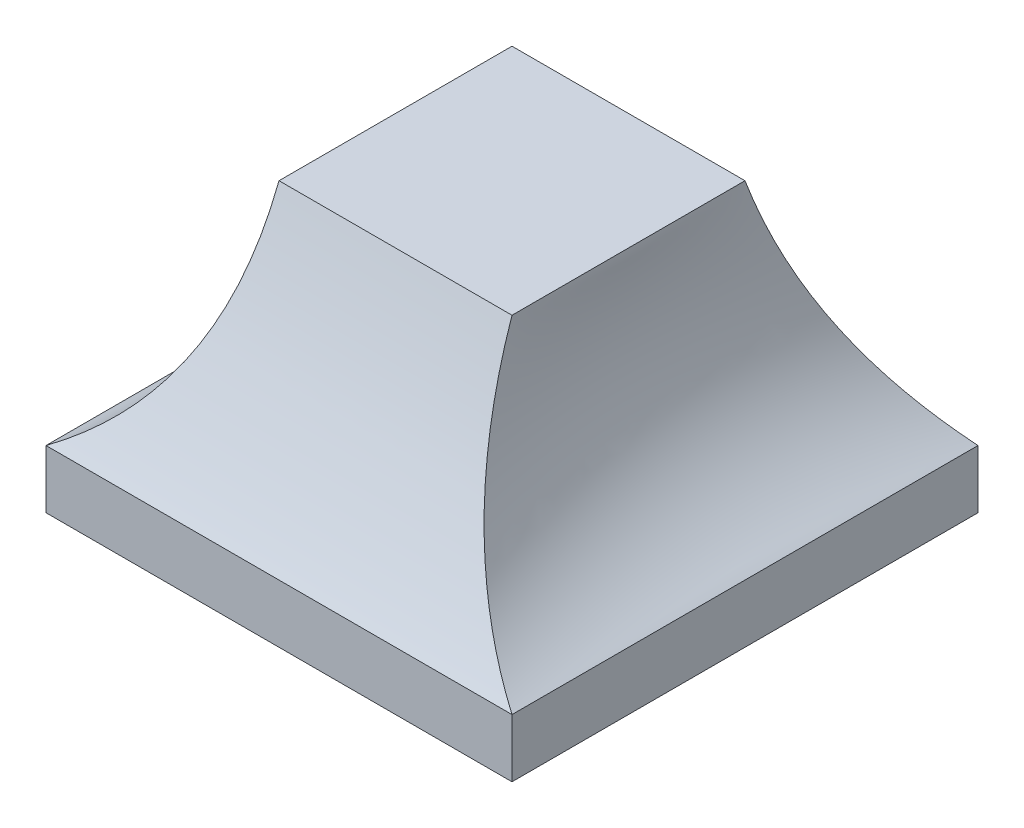
ISO-10303-21;
HEADER;
FILE_DESCRIPTION(('STEP AP214'),'2;1');
FILE_NAME('part.step','',(''),(''),'','','');
FILE_SCHEMA(('AUTOMOTIVE_DESIGN { 1 0 10303 214 1 1 1 1 }'));
ENDSEC;
DATA;
#1=APPLICATION_CONTEXT('core data for automotive mechanical design processes');
#2=APPLICATION_PROTOCOL_DEFINITION('international standard','automotive_design',2000,#1);
#3=PRODUCT_CONTEXT('',#1,'mechanical');
#4=PRODUCT('Part','Part','',(#3));
#5=PRODUCT_RELATED_PRODUCT_CATEGORY('part','',(#4));
#6=PRODUCT_DEFINITION_FORMATION('','',#4);
#7=PRODUCT_DEFINITION_CONTEXT('part definition',#1,'design');
#8=PRODUCT_DEFINITION('design','',#6,#7);
#9=PRODUCT_DEFINITION_SHAPE('','',#8);
#10=(LENGTH_UNIT() NAMED_UNIT(*) SI_UNIT(.MILLI.,.METRE.));
#11=(NAMED_UNIT(*) PLANE_ANGLE_UNIT() SI_UNIT($,.RADIAN.));
#12=(NAMED_UNIT(*) SI_UNIT($,.STERADIAN.) SOLID_ANGLE_UNIT());
#13=UNCERTAINTY_MEASURE_WITH_UNIT(LENGTH_MEASURE(1.E-05),#10,'distance_accuracy_value','');
#14=(GEOMETRIC_REPRESENTATION_CONTEXT(3) GLOBAL_UNCERTAINTY_ASSIGNED_CONTEXT((#13)) GLOBAL_UNIT_ASSIGNED_CONTEXT((#10,
#11,#12)) REPRESENTATION_CONTEXT('',''));
#15=CARTESIAN_POINT('',(0.,0.,0.));
#16=DIRECTION('',(0.,0.,1.));
#17=DIRECTION('',(1.,0.,0.));
#18=AXIS2_PLACEMENT_3D('',#15,#16,#17);
#19=CARTESIAN_POINT('',(0.,0.,0.));
#20=DIRECTION('',(0.,1.,0.));
#21=DIRECTION('',(0.,0.,1.));
#22=AXIS2_PLACEMENT_3D('',#19,#20,#21);
#23=PLANE('',#22);
#24=DIRECTION('',(0.,0.,-1.));
#25=VECTOR('',#24,1.);
#26=CARTESIAN_POINT('',(25.4,0.,-25.4));
#27=LINE('',#26,#25);
#28=CARTESIAN_POINT('',(25.4,0.,25.4));
#29=VERTEX_POINT('',#28);
#30=CARTESIAN_POINT('',(25.4,0.,-25.4));
#31=VERTEX_POINT('',#30);
#32=EDGE_CURVE('E416',#29,#31,#27,.T.);
#33=ORIENTED_EDGE('',*,*,#32,.F.);
#34=DIRECTION('',(1.,0.,0.));
#35=VECTOR('',#34,1.);
#36=CARTESIAN_POINT('',(-25.4,0.,25.4));
#37=LINE('',#36,#35);
#38=CARTESIAN_POINT('',(-25.4,0.,25.4));
#39=VERTEX_POINT('',#38);
#40=EDGE_CURVE('E175',#39,#29,#37,.T.);
#41=ORIENTED_EDGE('',*,*,#40,.F.);
#42=DIRECTION('',(0.,0.,1.));
#43=VECTOR('',#42,1.);
#44=CARTESIAN_POINT('',(-25.4,0.,-25.4));
#45=LINE('',#44,#43);
#46=CARTESIAN_POINT('',(-25.4,0.,-25.4));
#47=VERTEX_POINT('',#46);
#48=EDGE_CURVE('E423',#47,#39,#45,.T.);
#49=ORIENTED_EDGE('',*,*,#48,.F.);
#50=DIRECTION('',(-1.,0.,0.));
#51=VECTOR('',#50,1.);
#52=CARTESIAN_POINT('',(-25.4,0.,-25.4));
#53=LINE('',#52,#51);
#54=EDGE_CURVE('E420',#31,#47,#53,.T.);
#55=ORIENTED_EDGE('',*,*,#54,.F.);
#56=EDGE_LOOP('',(#33,#41,#49,#55));
#57=FACE_BOUND('',#56,.T.);
#58=CARTESIAN_POINT('',(-12.7,0.,-12.7));
#59=DIRECTION('',(0.,1.,0.));
#60=DIRECTION('',(0.,0.,1.));
#61=AXIS2_PLACEMENT_3D('',#58,#59,#60);
#62=CIRCLE('',#61,3.175);
#63=CARTESIAN_POINT('',(-12.7,0.,-9.525));
#64=VERTEX_POINT('',#63);
#65=EDGE_CURVE('E412',#64,#64,#62,.T.);
#66=ORIENTED_EDGE('',*,*,#65,.T.);
#67=EDGE_LOOP('',(#66));
#68=FACE_BOUND('',#67,.T.);
#69=CARTESIAN_POINT('',(12.7,0.,-12.7));
#70=DIRECTION('',(0.,1.,0.));
#71=DIRECTION('',(0.,0.,1.));
#72=AXIS2_PLACEMENT_3D('',#69,#70,#71);
#73=CIRCLE('',#72,3.40946307943457);
#74=CARTESIAN_POINT('',(12.7,0.,-9.29053692056542));
#75=VERTEX_POINT('',#74);
#76=EDGE_CURVE('E408',#75,#75,#73,.T.);
#77=ORIENTED_EDGE('',*,*,#76,.T.);
#78=EDGE_LOOP('',(#77));
#79=FACE_BOUND('',#78,.T.);
#80=CARTESIAN_POINT('',(12.7,0.,12.7));
#81=DIRECTION('',(0.,1.,0.));
#82=DIRECTION('',(0.,0.,-1.));
#83=AXIS2_PLACEMENT_3D('',#80,#81,#82);
#84=CIRCLE('',#83,3.40946307943457);
#85=CARTESIAN_POINT('',(12.7,0.,9.29053692056542));
#86=VERTEX_POINT('',#85);
#87=EDGE_CURVE('E405',#86,#86,#84,.T.);
#88=ORIENTED_EDGE('',*,*,#87,.T.);
#89=EDGE_LOOP('',(#88));
#90=FACE_BOUND('',#89,.T.);
#91=CARTESIAN_POINT('',(-12.7,0.,12.7));
#92=DIRECTION('',(0.,1.,0.));
#93=DIRECTION('',(0.,0.,-1.));
#94=AXIS2_PLACEMENT_3D('',#91,#92,#93);
#95=CIRCLE('',#94,3.175);
#96=CARTESIAN_POINT('',(-12.7,0.,9.525));
#97=VERTEX_POINT('',#96);
#98=EDGE_CURVE('E401',#97,#97,#95,.T.);
#99=ORIENTED_EDGE('',*,*,#98,.T.);
#100=EDGE_LOOP('',(#99));
#101=FACE_BOUND('',#100,.T.);
#102=ADVANCED_FACE('F139',(#57,#68,#79,#90,#101),#23,.F.);
#103=CARTESIAN_POINT('',(25.4,6.35,-25.4));
#104=DIRECTION('',(-1.,0.,0.));
#105=DIRECTION('',(0.,0.,1.));
#106=AXIS2_PLACEMENT_3D('',#103,#104,#105);
#107=PLANE('',#106);
#108=ORIENTED_EDGE('',*,*,#32,.T.);
#109=DIRECTION('',(0.,-1.,0.));
#110=VECTOR('',#109,1.);
#111=CARTESIAN_POINT('',(25.4,6.35,-25.4));
#112=LINE('',#111,#110);
#113=CARTESIAN_POINT('',(25.4,6.34999999999999,-25.4));
#114=VERTEX_POINT('',#113);
#115=EDGE_CURVE('E13',#114,#31,#112,.T.);
#116=ORIENTED_EDGE('',*,*,#115,.F.);
#117=DIRECTION('',(0.,0.,1.));
#118=VECTOR('',#117,1.);
#119=CARTESIAN_POINT('',(25.4,6.35,-25.4));
#120=LINE('',#119,#118);
#121=CARTESIAN_POINT('',(25.4,6.35,25.4));
#122=VERTEX_POINT('',#121);
#123=EDGE_CURVE('E225',#122,#114,#120,.F.);
#124=ORIENTED_EDGE('',*,*,#123,.F.);
#125=DIRECTION('',(0.,-1.,0.));
#126=VECTOR('',#125,1.);
#127=CARTESIAN_POINT('',(25.4,6.35,25.4));
#128=LINE('',#127,#126);
#129=EDGE_CURVE('E437',#122,#29,#128,.T.);
#130=ORIENTED_EDGE('',*,*,#129,.T.);
#131=EDGE_LOOP('',(#108,#116,#124,#130));
#132=FACE_BOUND('',#131,.T.);
#133=ADVANCED_FACE('F141',(#132),#107,.F.);
#134=CARTESIAN_POINT('',(-25.4,6.35,-25.4));
#135=DIRECTION('',(0.,0.,1.));
#136=DIRECTION('',(1.,0.,0.));
#137=AXIS2_PLACEMENT_3D('',#134,#135,#136);
#138=PLANE('',#137);
#139=ORIENTED_EDGE('',*,*,#54,.T.);
#140=DIRECTION('',(0.,-1.,0.));
#141=VECTOR('',#140,1.);
#142=CARTESIAN_POINT('',(-25.4,6.35,-25.4));
#143=LINE('',#142,#141);
#144=CARTESIAN_POINT('',(-25.4,6.35,-25.4));
#145=VERTEX_POINT('',#144);
#146=EDGE_CURVE('E150',#145,#47,#143,.T.);
#147=ORIENTED_EDGE('',*,*,#146,.F.);
#148=DIRECTION('',(1.,0.,0.));
#149=VECTOR('',#148,1.);
#150=CARTESIAN_POINT('',(-25.4,6.35,-25.4));
#151=LINE('',#150,#149);
#152=EDGE_CURVE('E143',#114,#145,#151,.F.);
#153=ORIENTED_EDGE('',*,*,#152,.F.);
#154=ORIENTED_EDGE('',*,*,#115,.T.);
#155=EDGE_LOOP('',(#139,#147,#153,#154));
#156=FACE_BOUND('',#155,.T.);
#157=ADVANCED_FACE('F463',(#156),#138,.F.);
#158=CARTESIAN_POINT('',(-25.4,6.35,-25.4));
#159=DIRECTION('',(1.,0.,0.));
#160=DIRECTION('',(0.,0.,-1.));
#161=AXIS2_PLACEMENT_3D('',#158,#159,#160);
#162=PLANE('',#161);
#163=ORIENTED_EDGE('',*,*,#48,.T.);
#164=DIRECTION('',(0.,-1.,0.));
#165=VECTOR('',#164,1.);
#166=CARTESIAN_POINT('',(-25.4,6.35,25.4));
#167=LINE('',#166,#165);
#168=CARTESIAN_POINT('',(-25.4,6.35,25.4));
#169=VERTEX_POINT('',#168);
#170=EDGE_CURVE('E158',#169,#39,#167,.T.);
#171=ORIENTED_EDGE('',*,*,#170,.F.);
#172=DIRECTION('',(0.,0.,-1.));
#173=VECTOR('',#172,1.);
#174=CARTESIAN_POINT('',(-25.4,6.35,-25.4));
#175=LINE('',#174,#173);
#176=EDGE_CURVE('E432',#145,#169,#175,.F.);
#177=ORIENTED_EDGE('',*,*,#176,.F.);
#178=ORIENTED_EDGE('',*,*,#146,.T.);
#179=EDGE_LOOP('',(#163,#171,#177,#178));
#180=FACE_BOUND('',#179,.T.);
#181=ADVANCED_FACE('F446',(#180),#162,.F.);
#182=CARTESIAN_POINT('',(-25.4,6.35,25.4));
#183=DIRECTION('',(0.,0.,-1.));
#184=DIRECTION('',(-1.,0.,0.));
#185=AXIS2_PLACEMENT_3D('',#182,#183,#184);
#186=PLANE('',#185);
#187=ORIENTED_EDGE('',*,*,#40,.T.);
#188=ORIENTED_EDGE('',*,*,#129,.F.);
#189=DIRECTION('',(-1.,0.,0.));
#190=VECTOR('',#189,1.);
#191=CARTESIAN_POINT('',(-25.4,6.35,25.4));
#192=LINE('',#191,#190);
#193=EDGE_CURVE('E434',#169,#122,#192,.F.);
#194=ORIENTED_EDGE('',*,*,#193,.F.);
#195=ORIENTED_EDGE('',*,*,#170,.T.);
#196=EDGE_LOOP('',(#187,#188,#194,#195));
#197=FACE_BOUND('',#196,.T.);
#198=ADVANCED_FACE('F451',(#197),#186,.F.);
#199=CARTESIAN_POINT('',(-12.7,6.35,-12.7));
#200=DIRECTION('',(0.,-1.,0.));
#201=DIRECTION('',(0.,0.,-1.));
#202=AXIS2_PLACEMENT_3D('',#199,#200,#201);
#203=CYLINDRICAL_SURFACE('',#202,3.175);
#204=CARTESIAN_POINT('',(-12.7,6.35,-12.7));
#205=DIRECTION('',(0.,1.,0.));
#206=DIRECTION('',(0.,0.,1.));
#207=AXIS2_PLACEMENT_3D('',#204,#205,#206);
#208=CIRCLE('',#207,3.175);
#209=CARTESIAN_POINT('',(-12.7,6.35,-9.525));
#210=VERTEX_POINT('',#209);
#211=EDGE_CURVE('E393',#210,#210,#208,.T.);
#212=ORIENTED_EDGE('',*,*,#211,.T.);
#213=EDGE_LOOP('',(#212));
#214=FACE_BOUND('',#213,.T.);
#215=ORIENTED_EDGE('',*,*,#65,.F.);
#216=EDGE_LOOP('',(#215));
#217=FACE_BOUND('',#216,.T.);
#218=ADVANCED_FACE('F453',(#214,#217),#203,.F.);
#219=CARTESIAN_POINT('',(12.7,6.35,-12.7));
#220=DIRECTION('',(0.,-1.,0.));
#221=DIRECTION('',(0.,0.,-1.));
#222=AXIS2_PLACEMENT_3D('',#219,#220,#221);
#223=CYLINDRICAL_SURFACE('',#222,3.40946307943457);
#224=CARTESIAN_POINT('',(12.7,6.35,-12.7));
#225=DIRECTION('',(0.,1.,0.));
#226=DIRECTION('',(0.,0.,1.));
#227=AXIS2_PLACEMENT_3D('',#224,#225,#226);
#228=CIRCLE('',#227,3.40946307943457);
#229=CARTESIAN_POINT('',(12.7,6.35,-9.29053692056542));
#230=VERTEX_POINT('',#229);
#231=EDGE_CURVE('E390',#230,#230,#228,.T.);
#232=ORIENTED_EDGE('',*,*,#231,.T.);
#233=EDGE_LOOP('',(#232));
#234=FACE_BOUND('',#233,.T.);
#235=ORIENTED_EDGE('',*,*,#76,.F.);
#236=EDGE_LOOP('',(#235));
#237=FACE_BOUND('',#236,.T.);
#238=ADVANCED_FACE('F460',(#234,#237),#223,.F.);
#239=CARTESIAN_POINT('',(12.7,6.35,12.7));
#240=DIRECTION('',(0.,-1.,0.));
#241=DIRECTION('',(0.,0.,-1.));
#242=AXIS2_PLACEMENT_3D('',#239,#240,#241);
#243=CYLINDRICAL_SURFACE('',#242,3.40946307943457);
#244=CARTESIAN_POINT('',(12.7,6.35,12.7));
#245=DIRECTION('',(0.,1.,0.));
#246=DIRECTION('',(0.,0.,-1.));
#247=AXIS2_PLACEMENT_3D('',#244,#245,#246);
#248=CIRCLE('',#247,3.40946307943457);
#249=CARTESIAN_POINT('',(12.7,6.35,9.29053692056542));
#250=VERTEX_POINT('',#249);
#251=EDGE_CURVE('E397',#250,#250,#248,.T.);
#252=ORIENTED_EDGE('',*,*,#251,.T.);
#253=EDGE_LOOP('',(#252));
#254=FACE_BOUND('',#253,.T.);
#255=ORIENTED_EDGE('',*,*,#87,.F.);
#256=EDGE_LOOP('',(#255));
#257=FACE_BOUND('',#256,.T.);
#258=ADVANCED_FACE('F472',(#254,#257),#243,.F.);
#259=CARTESIAN_POINT('',(-12.7,6.35,12.7));
#260=DIRECTION('',(0.,-1.,0.));
#261=DIRECTION('',(0.,0.,-1.));
#262=AXIS2_PLACEMENT_3D('',#259,#260,#261);
#263=CYLINDRICAL_SURFACE('',#262,3.175);
#264=CARTESIAN_POINT('',(-12.7,6.35,12.7));
#265=DIRECTION('',(0.,1.,0.));
#266=DIRECTION('',(0.,0.,-1.));
#267=AXIS2_PLACEMENT_3D('',#264,#265,#266);
#268=CIRCLE('',#267,3.175);
#269=CARTESIAN_POINT('',(-12.7,6.35,9.525));
#270=VERTEX_POINT('',#269);
#271=EDGE_CURVE('E243',#270,#270,#268,.T.);
#272=ORIENTED_EDGE('',*,*,#271,.T.);
#273=EDGE_LOOP('',(#272));
#274=FACE_BOUND('',#273,.T.);
#275=ORIENTED_EDGE('',*,*,#98,.F.);
#276=EDGE_LOOP('',(#275));
#277=FACE_BOUND('',#276,.T.);
#278=ADVANCED_FACE('F259',(#274,#277),#263,.F.);
#279=CARTESIAN_POINT('',(0.,6.35,0.));
#280=DIRECTION('',(0.,1.,0.));
#281=DIRECTION('',(0.,0.,1.));
#282=AXIS2_PLACEMENT_3D('',#279,#280,#281);
#283=PLANE('',#282);
#284=ORIENTED_EDGE('',*,*,#271,.F.);
#285=EDGE_LOOP('',(#284));
#286=FACE_BOUND('',#285,.T.);
#287=ADVANCED_FACE('F479',(#286),#283,.F.);
#288=ORIENTED_EDGE('',*,*,#231,.F.);
#289=EDGE_LOOP('',(#288));
#290=FACE_BOUND('',#289,.T.);
#291=ADVANCED_FACE('F494',(#290),#283,.F.);
#292=ORIENTED_EDGE('',*,*,#211,.F.);
#293=EDGE_LOOP('',(#292));
#294=FACE_BOUND('',#293,.T.);
#295=ADVANCED_FACE('F490',(#294),#283,.F.);
#296=ORIENTED_EDGE('',*,*,#251,.F.);
#297=EDGE_LOOP('',(#296));
#298=FACE_BOUND('',#297,.T.);
#299=ADVANCED_FACE('F254',(#298),#283,.F.);
#300=CARTESIAN_POINT('',(0.,31.35,0.));
#301=DIRECTION('',(0.,-1.,0.));
#302=DIRECTION('',(0.,0.,-1.));
#303=AXIS2_PLACEMENT_3D('',#300,#301,#302);
#304=PLANE('',#303);
#305=DIRECTION('',(0.,0.,-1.));
#306=VECTOR('',#305,1.);
#307=CARTESIAN_POINT('',(12.7,31.35,12.7));
#308=LINE('',#307,#306);
#309=CARTESIAN_POINT('',(12.7,31.35,12.7));
#310=VERTEX_POINT('',#309);
#311=CARTESIAN_POINT('',(12.7,31.35,-12.7));
#312=VERTEX_POINT('',#311);
#313=EDGE_CURVE('E213',#310,#312,#308,.T.);
#314=ORIENTED_EDGE('',*,*,#313,.T.);
#315=DIRECTION('',(-1.,0.,0.));
#316=VECTOR('',#315,1.);
#317=CARTESIAN_POINT('',(-12.7,31.35,-12.7));
#318=LINE('',#317,#316);
#319=CARTESIAN_POINT('',(-12.7,31.35,-12.7));
#320=VERTEX_POINT('',#319);
#321=EDGE_CURVE('E200',#312,#320,#318,.T.);
#322=ORIENTED_EDGE('',*,*,#321,.T.);
#323=DIRECTION('',(0.,0.,1.));
#324=VECTOR('',#323,1.);
#325=CARTESIAN_POINT('',(-12.7,31.35,12.7));
#326=LINE('',#325,#324);
#327=CARTESIAN_POINT('',(-12.7,31.35,12.7));
#328=VERTEX_POINT('',#327);
#329=EDGE_CURVE('E212',#320,#328,#326,.T.);
#330=ORIENTED_EDGE('',*,*,#329,.T.);
#331=DIRECTION('',(1.,0.,0.));
#332=VECTOR('',#331,1.);
#333=CARTESIAN_POINT('',(-12.7,31.35,12.7));
#334=LINE('',#333,#332);
#335=EDGE_CURVE('E232',#328,#310,#334,.T.);
#336=ORIENTED_EDGE('',*,*,#335,.T.);
#337=EDGE_LOOP('',(#314,#322,#330,#336));
#338=FACE_BOUND('',#337,.T.);
#339=ADVANCED_FACE('F230',(#338),#304,.F.);
#340=CARTESIAN_POINT('',(25.4,6.35,25.4));
#341=CARTESIAN_POINT('',(17.1089670779894,11.4462295701942,21.1666666666667));
#342=CARTESIAN_POINT('',(12.875633744656,19.7795629035275,16.9333333333333));
#343=CARTESIAN_POINT('',(12.7,31.35,12.7));
#344=CARTESIAN_POINT('',(25.4,6.35,23.2833333333333));
#345=CARTESIAN_POINT('',(16.8323057423977,11.4462295701942,19.4027777777778));
#346=CARTESIAN_POINT('',(12.5989724090644,19.7795629035275,15.5222222222222));
#347=CARTESIAN_POINT('',(12.7,31.35,11.6416666666667));
#348=CARTESIAN_POINT('',(25.4,6.35000000000001,19.05));
#349=CARTESIAN_POINT('',(16.3250932938131,11.4462295701942,15.875));
#350=CARTESIAN_POINT('',(12.0917599604798,19.7795629035276,12.7));
#351=CARTESIAN_POINT('',(12.7,31.3500000000001,9.525));
#352=CARTESIAN_POINT('',(25.4,6.34999999999999,12.7));
#353=CARTESIAN_POINT('',(15.7371879556808,11.4462295701942,10.5833333333333));
#354=CARTESIAN_POINT('',(11.5038546223475,19.7795629035275,8.46666666666666));
#355=CARTESIAN_POINT('',(12.7,31.3499999999999,6.35));
#356=CARTESIAN_POINT('',(25.4,6.35000000000001,6.35));
#357=CARTESIAN_POINT('',(15.3567786192424,11.4462295701942,5.29166666666667));
#358=CARTESIAN_POINT('',(11.123445285909,19.7795629035276,4.23333333333333));
#359=CARTESIAN_POINT('',(12.7,31.35,3.175));
#360=CARTESIAN_POINT('',(25.4,6.35,2.11666666666667));
#361=CARTESIAN_POINT('',(15.2645581740451,11.4462295701942,1.76388888888889));
#362=CARTESIAN_POINT('',(11.0312248407118,19.7795629035275,1.41111111111111));
#363=CARTESIAN_POINT('',(12.7,31.35,1.05833333333333));
#364=CARTESIAN_POINT('',(25.4,6.35,0.));
#365=CARTESIAN_POINT('',(15.2645581740451,11.4462295701942,0.));
#366=CARTESIAN_POINT('',(11.0312248407118,19.7795629035275,0.));
#367=CARTESIAN_POINT('',(12.7,31.35,0.));
#368=CARTESIAN_POINT('',(25.4,6.35,-2.11666666666667));
#369=CARTESIAN_POINT('',(15.2645581740451,11.4462295701942,-1.76388888888889));
#370=CARTESIAN_POINT('',(11.0312248407118,19.7795629035275,-1.41111111111111));
#371=CARTESIAN_POINT('',(12.7,31.35,-1.05833333333333));
#372=CARTESIAN_POINT('',(25.4,6.35000000000001,-6.35000000000001));
#373=CARTESIAN_POINT('',(15.3567786192424,11.4462295701942,-5.29166666666668));
#374=CARTESIAN_POINT('',(11.123445285909,19.7795629035276,-4.23333333333334));
#375=CARTESIAN_POINT('',(12.7,31.35,-3.17500000000001));
#376=CARTESIAN_POINT('',(25.4,6.34999999999999,-12.7));
#377=CARTESIAN_POINT('',(15.7371879556808,11.4462295701942,-10.5833333333333));
#378=CARTESIAN_POINT('',(11.5038546223475,19.7795629035275,-8.46666666666666));
#379=CARTESIAN_POINT('',(12.7,31.35,-6.35));
#380=CARTESIAN_POINT('',(25.4,6.35000000000001,-19.05));
#381=CARTESIAN_POINT('',(16.3250932938131,11.4462295701942,-15.875));
#382=CARTESIAN_POINT('',(12.0917599604798,19.7795629035275,-12.7));
#383=CARTESIAN_POINT('',(12.7,31.35,-9.525));
#384=CARTESIAN_POINT('',(25.4,6.35,-23.2833333333333));
#385=CARTESIAN_POINT('',(16.8323057423977,11.4462295701942,-19.4027777777778));
#386=CARTESIAN_POINT('',(12.5989724090644,19.7795629035275,-15.5222222222222));
#387=CARTESIAN_POINT('',(12.7,31.35,-11.6416666666667));
#388=CARTESIAN_POINT('',(25.4,6.35,-25.4));
#389=CARTESIAN_POINT('',(17.1089670779894,11.4462295701942,-21.1666666666667));
#390=CARTESIAN_POINT('',(12.875633744656,19.7795629035275,-16.9333333333333));
#391=CARTESIAN_POINT('',(12.7,31.35,-12.7));
#392=B_SPLINE_SURFACE_WITH_KNOTS('',3,3,((#340,#341,#342,#343),(#344,#345,#346,#347),(#348,#349,
#350,#351),(#352,#353,#354,#355),(#356,#357,#358,#359),(#360,#361,#362,#363),(#364,#365,#366,
#367),(#368,#369,#370,#371),(#372,#373,#374,#375),(#376,#377,#378,#379),(#380,#381,#382,#383),
(#384,#385,#386,#387),(#388,#389,#390,#391)),.UNSPECIFIED.,.F.,.F.,.F.,(4,1,1,1,3,1,1,1,4),(4,
4),(0.75,0.78125,0.8125,0.84375,0.875,0.90625,0.9375,0.96875,1.),(0.,1.),.UNSPECIFIED.);
#393=CARTESIAN_POINT('',(25.4,6.35,-25.4));
#394=CARTESIAN_POINT('',(17.1089670779894,11.4462295701942,-21.1666666666667));
#395=CARTESIAN_POINT('',(12.875633744656,19.7795629035275,-16.9333333333333));
#396=CARTESIAN_POINT('',(12.7,31.35,-12.7));
#397=B_SPLINE_CURVE_WITH_KNOTS('',3,(#393,#394,#395,#396),.UNSPECIFIED.,.F.,.F.,(4,4),(0.,1.),.UNSPECIFIED.);
#398=EDGE_CURVE('E204',#114,#312,#397,.T.);
#399=CARTESIAN_POINT('',(25.4,6.35,25.4));
#400=CARTESIAN_POINT('',(17.1089670779894,11.4462295701942,21.1666666666667));
#401=CARTESIAN_POINT('',(12.875633744656,19.7795629035275,16.9333333333333));
#402=CARTESIAN_POINT('',(12.7,31.35,12.7));
#403=B_SPLINE_CURVE_WITH_KNOTS('',3,(#399,#400,#401,#402),.UNSPECIFIED.,.F.,.F.,(4,4),(0.,1.),.UNSPECIFIED.);
#404=EDGE_CURVE('E227',#122,#310,#403,.T.);
#405=ORIENTED_EDGE('',*,*,#123,.T.);
#406=ORIENTED_EDGE('',*,*,#398,.T.);
#407=ORIENTED_EDGE('',*,*,#313,.F.);
#408=ORIENTED_EDGE('',*,*,#404,.F.);
#409=EDGE_LOOP('',(#405,#406,#407,#408));
#410=FACE_BOUND('',#409,.T.);
#411=ADVANCED_FACE('F220',(#410),#392,.T.);
#412=CARTESIAN_POINT('',(-25.4,6.35,25.4));
#413=CARTESIAN_POINT('',(-17.1089670779894,11.4462295701942,21.1666666666667));
#414=CARTESIAN_POINT('',(-12.875633744656,19.7795629035275,16.9333333333333));
#415=CARTESIAN_POINT('',(-12.7,31.35,12.7));
#416=CARTESIAN_POINT('',(-21.1666666666667,6.35,25.4));
#417=CARTESIAN_POINT('',(-14.1345119713948,11.4462295701942,21.1666666666667));
#418=CARTESIAN_POINT('',(-10.6067341936171,19.7795629035275,16.9333333333333));
#419=CARTESIAN_POINT('',(-10.5833333333333,31.35,12.7));
#420=CARTESIAN_POINT('',(-12.7,6.35000000000001,25.4));
#421=CARTESIAN_POINT('',(-8.37004264860026,11.4462295701942,21.1666666666667));
#422=CARTESIAN_POINT('',(-6.2533759819336,19.7795629035276,16.9333333333334));
#423=CARTESIAN_POINT('',(-6.35,31.3500000000001,12.7));
#424=CARTESIAN_POINT('',(0.,6.34999999999999,25.4));
#425=CARTESIAN_POINT('',(0.,11.4462295701942,21.1666666666666));
#426=CARTESIAN_POINT('',(0.,19.7795629035275,16.9333333333333));
#427=CARTESIAN_POINT('',(0.,31.3499999999999,12.7));
#428=CARTESIAN_POINT('',(12.7,6.35000000000001,25.4));
#429=CARTESIAN_POINT('',(8.37004264860026,11.4462295701942,21.1666666666667));
#430=CARTESIAN_POINT('',(6.2533759819336,19.7795629035276,16.9333333333334));
#431=CARTESIAN_POINT('',(6.35000000000001,31.35,12.7));
#432=CARTESIAN_POINT('',(21.1666666666667,6.35,25.4));
#433=CARTESIAN_POINT('',(14.1345119713948,11.4462295701942,21.1666666666667));
#434=CARTESIAN_POINT('',(10.6067341936171,19.7795629035275,16.9333333333333));
#435=CARTESIAN_POINT('',(10.5833333333333,31.35,12.7));
#436=CARTESIAN_POINT('',(25.4,6.35,25.4));
#437=CARTESIAN_POINT('',(17.1089670779894,11.4462295701942,21.1666666666667));
#438=CARTESIAN_POINT('',(12.875633744656,19.7795629035275,16.9333333333333));
#439=CARTESIAN_POINT('',(12.7,31.35,12.7));
#440=B_SPLINE_SURFACE_WITH_KNOTS('',3,3,((#412,#413,#414,#415),(#416,#417,#418,#419),(#420,#421,
#422,#423),(#424,#425,#426,#427),(#428,#429,#430,#431),(#432,#433,#434,#435),(#436,#437,#438,
#439)),.UNSPECIFIED.,.F.,.F.,.F.,(4,1,1,1,4),(4,4),(0.5,0.5625,0.625,0.6875,0.75),(0.,1.),.UNSPECIFIED.);
#441=CARTESIAN_POINT('',(-25.4,6.35,25.4));
#442=CARTESIAN_POINT('',(-17.1089670779894,11.4462295701942,21.1666666666667));
#443=CARTESIAN_POINT('',(-12.875633744656,19.7795629035275,16.9333333333333));
#444=CARTESIAN_POINT('',(-12.7,31.35,12.7));
#445=B_SPLINE_CURVE_WITH_KNOTS('',3,(#441,#442,#443,#444),.UNSPECIFIED.,.F.,.F.,(4,4),(0.,1.),.UNSPECIFIED.);
#446=EDGE_CURVE('E298',#169,#328,#445,.T.);
#447=ORIENTED_EDGE('',*,*,#193,.T.);
#448=ORIENTED_EDGE('',*,*,#404,.T.);
#449=ORIENTED_EDGE('',*,*,#335,.F.);
#450=ORIENTED_EDGE('',*,*,#446,.F.);
#451=EDGE_LOOP('',(#447,#448,#449,#450));
#452=FACE_BOUND('',#451,.T.);
#453=ADVANCED_FACE('F321',(#452),#440,.T.);
#454=CARTESIAN_POINT('',(-25.4,6.35,-25.4));
#455=CARTESIAN_POINT('',(-17.1089670779894,11.4462295701942,-21.1666666666667));
#456=CARTESIAN_POINT('',(-12.875633744656,19.7795629035275,-16.9333333333333));
#457=CARTESIAN_POINT('',(-12.7,31.35,-12.7));
#458=CARTESIAN_POINT('',(-25.4,6.35,-23.2833333333333));
#459=CARTESIAN_POINT('',(-16.8323057423977,11.4462295701942,-19.4027777777778));
#460=CARTESIAN_POINT('',(-12.5989724090644,19.7795629035275,-15.5222222222222));
#461=CARTESIAN_POINT('',(-12.7,31.35,-11.6416666666667));
#462=CARTESIAN_POINT('',(-25.4,6.35,-19.05));
#463=CARTESIAN_POINT('',(-16.3250932938131,11.4462295701942,-15.875));
#464=CARTESIAN_POINT('',(-12.0917599604797,19.7795629035276,-12.7));
#465=CARTESIAN_POINT('',(-12.7,31.3500000000001,-9.525));
#466=CARTESIAN_POINT('',(-25.4,6.35,-12.7));
#467=CARTESIAN_POINT('',(-15.7371879556808,11.4462295701942,-10.5833333333333));
#468=CARTESIAN_POINT('',(-11.5038546223475,19.7795629035275,-8.46666666666667));
#469=CARTESIAN_POINT('',(-12.7,31.35,-6.35));
#470=CARTESIAN_POINT('',(-25.4,6.35,-6.34999999999999));
#471=CARTESIAN_POINT('',(-15.3567786192423,11.4462295701942,-5.29166666666666));
#472=CARTESIAN_POINT('',(-11.123445285909,19.7795629035275,-4.23333333333333));
#473=CARTESIAN_POINT('',(-12.7,31.35,-3.17500000000001));
#474=CARTESIAN_POINT('',(-25.4,6.35,-2.11666666666667));
#475=CARTESIAN_POINT('',(-15.2645581740451,11.4462295701942,-1.76388888888889));
#476=CARTESIAN_POINT('',(-11.0312248407118,19.7795629035275,-1.41111111111111));
#477=CARTESIAN_POINT('',(-12.7,31.35,-1.05833333333333));
#478=CARTESIAN_POINT('',(-25.4,6.35,2.11666666666667));
#479=CARTESIAN_POINT('',(-15.2645581740451,11.4462295701942,1.76388888888889));
#480=CARTESIAN_POINT('',(-11.0312248407118,19.7795629035275,1.41111111111111));
#481=CARTESIAN_POINT('',(-12.7,31.35,1.05833333333333));
#482=CARTESIAN_POINT('',(-25.4,6.35000000000001,6.35000000000002));
#483=CARTESIAN_POINT('',(-15.3567786192424,11.4462295701942,5.29166666666668));
#484=CARTESIAN_POINT('',(-11.123445285909,19.7795629035276,4.23333333333335));
#485=CARTESIAN_POINT('',(-12.7,31.3500000000001,3.17500000000002));
#486=CARTESIAN_POINT('',(-25.4,6.34999999999999,12.7));
#487=CARTESIAN_POINT('',(-15.7371879556808,11.4462295701942,10.5833333333333));
#488=CARTESIAN_POINT('',(-11.5038546223475,19.7795629035275,8.46666666666665));
#489=CARTESIAN_POINT('',(-12.7,31.3499999999999,6.34999999999999));
#490=CARTESIAN_POINT('',(-25.4,6.35000000000001,19.05));
#491=CARTESIAN_POINT('',(-16.3250932938131,11.4462295701942,15.875));
#492=CARTESIAN_POINT('',(-12.0917599604798,19.7795629035276,12.7));
#493=CARTESIAN_POINT('',(-12.7,31.35,9.52500000000001));
#494=CARTESIAN_POINT('',(-25.4,6.35,23.2833333333333));
#495=CARTESIAN_POINT('',(-16.8323057423977,11.4462295701942,19.4027777777778));
#496=CARTESIAN_POINT('',(-12.5989724090644,19.7795629035275,15.5222222222222));
#497=CARTESIAN_POINT('',(-12.7,31.35,11.6416666666667));
#498=CARTESIAN_POINT('',(-25.4,6.35,25.4));
#499=CARTESIAN_POINT('',(-17.1089670779894,11.4462295701942,21.1666666666667));
#500=CARTESIAN_POINT('',(-12.875633744656,19.7795629035275,16.9333333333333));
#501=CARTESIAN_POINT('',(-12.7,31.35,12.7));
#502=B_SPLINE_SURFACE_WITH_KNOTS('',3,3,((#454,#455,#456,#457),(#458,#459,#460,#461),(#462,#463,
#464,#465),(#466,#467,#468,#469),(#470,#471,#472,#473),(#474,#475,#476,#477),(#478,#479,#480,
#481),(#482,#483,#484,#485),(#486,#487,#488,#489),(#490,#491,#492,#493),(#494,#495,#496,#497),
(#498,#499,#500,#501)),.UNSPECIFIED.,.F.,.F.,.F.,(4,1,1,1,2,1,1,1,4),(4,4),(0.25,0.28125,0.3125,
0.34375,0.375,0.40625,0.4375,0.46875,0.5),(0.,1.),.UNSPECIFIED.);
#503=CARTESIAN_POINT('',(-25.4,6.35,-25.4));
#504=CARTESIAN_POINT('',(-17.1089670779894,11.4462295701942,-21.1666666666667));
#505=CARTESIAN_POINT('',(-12.875633744656,19.7795629035275,-16.9333333333333));
#506=CARTESIAN_POINT('',(-12.7,31.35,-12.7));
#507=B_SPLINE_CURVE_WITH_KNOTS('',3,(#503,#504,#505,#506),.UNSPECIFIED.,.F.,.F.,(4,4),(0.,1.),.UNSPECIFIED.);
#508=EDGE_CURVE('E206',#145,#320,#507,.T.);
#509=ORIENTED_EDGE('',*,*,#176,.T.);
#510=ORIENTED_EDGE('',*,*,#446,.T.);
#511=ORIENTED_EDGE('',*,*,#329,.F.);
#512=ORIENTED_EDGE('',*,*,#508,.F.);
#513=EDGE_LOOP('',(#509,#510,#511,#512));
#514=FACE_BOUND('',#513,.T.);
#515=ADVANCED_FACE('F296',(#514),#502,.T.);
#516=CARTESIAN_POINT('',(25.4,6.35,-25.4));
#517=CARTESIAN_POINT('',(17.1089670779894,11.4462295701942,-21.1666666666667));
#518=CARTESIAN_POINT('',(12.875633744656,19.7795629035275,-16.9333333333333));
#519=CARTESIAN_POINT('',(12.7,31.35,-12.7));
#520=CARTESIAN_POINT('',(21.1666666666667,6.35,-25.4));
#521=CARTESIAN_POINT('',(14.1345119713948,11.4462295701942,-21.1666666666667));
#522=CARTESIAN_POINT('',(10.6067341936171,19.7795629035275,-16.9333333333333));
#523=CARTESIAN_POINT('',(10.5833333333333,31.35,-12.7));
#524=CARTESIAN_POINT('',(12.7,6.34999999999999,-25.4));
#525=CARTESIAN_POINT('',(8.37004264860025,11.4462295701942,-21.1666666666667));
#526=CARTESIAN_POINT('',(6.25337598193359,19.7795629035275,-16.9333333333333));
#527=CARTESIAN_POINT('',(6.35,31.35,-12.7));
#528=CARTESIAN_POINT('',(0.,6.35000000000001,-25.4));
#529=CARTESIAN_POINT('',(0.,11.4462295701942,-21.1666666666667));
#530=CARTESIAN_POINT('',(0.,19.7795629035275,-16.9333333333333));
#531=CARTESIAN_POINT('',(0.,31.35,-12.7));
#532=CARTESIAN_POINT('',(-12.7,6.35,-25.4));
#533=CARTESIAN_POINT('',(-8.37004264860027,11.4462295701942,-21.1666666666667));
#534=CARTESIAN_POINT('',(-6.2533759819336,19.7795629035275,-16.9333333333333));
#535=CARTESIAN_POINT('',(-6.35,31.35,-12.7));
#536=CARTESIAN_POINT('',(-21.1666666666667,6.35,-25.4));
#537=CARTESIAN_POINT('',(-14.1345119713948,11.4462295701942,-21.1666666666667));
#538=CARTESIAN_POINT('',(-10.6067341936171,19.7795629035275,-16.9333333333333));
#539=CARTESIAN_POINT('',(-10.5833333333333,31.35,-12.7));
#540=CARTESIAN_POINT('',(-25.4,6.35,-25.4));
#541=CARTESIAN_POINT('',(-17.1089670779894,11.4462295701942,-21.1666666666667));
#542=CARTESIAN_POINT('',(-12.875633744656,19.7795629035275,-16.9333333333333));
#543=CARTESIAN_POINT('',(-12.7,31.35,-12.7));
#544=B_SPLINE_SURFACE_WITH_KNOTS('',3,3,((#516,#517,#518,#519),(#520,#521,#522,#523),(#524,#525,
#526,#527),(#528,#529,#530,#531),(#532,#533,#534,#535),(#536,#537,#538,#539),(#540,#541,#542,
#543)),.UNSPECIFIED.,.F.,.F.,.F.,(4,1,1,1,4),(4,4),(0.,0.0625,0.125,0.1875,0.25),(0.,1.),.UNSPECIFIED.);
#545=ORIENTED_EDGE('',*,*,#152,.T.);
#546=ORIENTED_EDGE('',*,*,#508,.T.);
#547=ORIENTED_EDGE('',*,*,#321,.F.);
#548=ORIENTED_EDGE('',*,*,#398,.F.);
#549=EDGE_LOOP('',(#545,#546,#547,#548));
#550=FACE_BOUND('',#549,.T.);
#551=ADVANCED_FACE('F203',(#550),#544,.T.);
#552=CLOSED_SHELL('',(#102,#133,#157,#181,#198,#218,#238,#258,#278,#287,#291,#295,#299,#339,
#411,#453,#515,#551));
#553=MANIFOLD_SOLID_BREP('B2',#552);
#554=ADVANCED_BREP_SHAPE_REPRESENTATION('',(#18,#553),#14);
#555=SHAPE_DEFINITION_REPRESENTATION(#9,#554);
ENDSEC;
END-ISO-10303-21;
